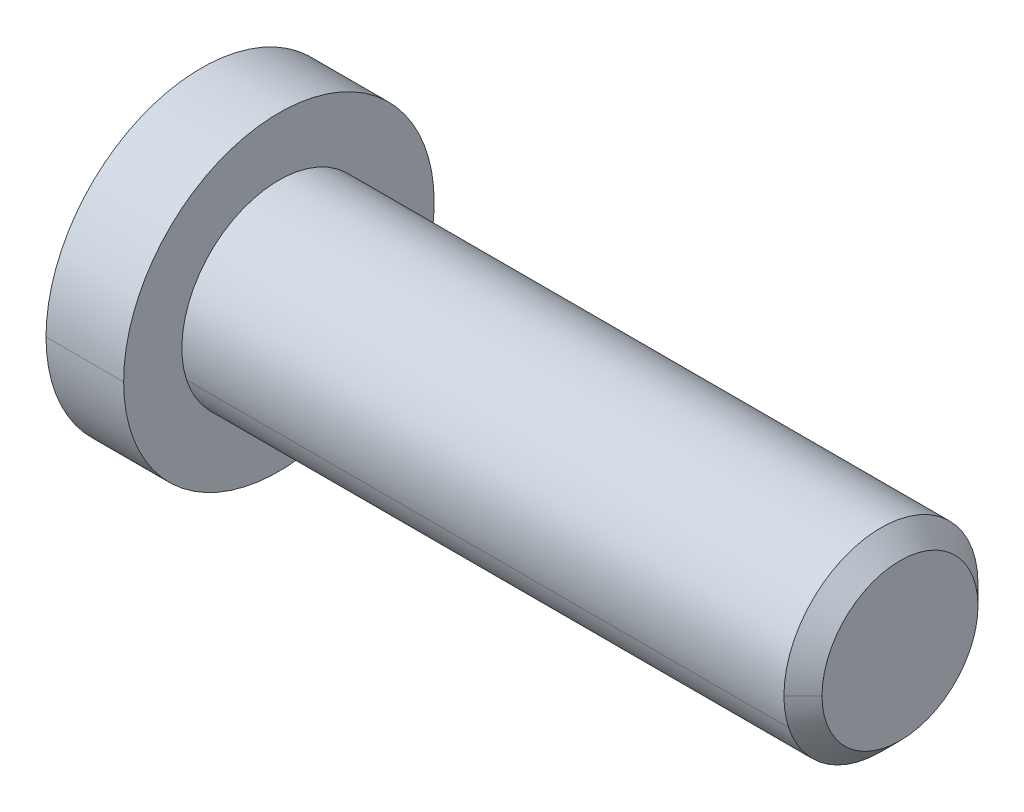
ISO-10303-21;
HEADER;
FILE_DESCRIPTION(('STEP AP214'),'2;1');
FILE_NAME('part.step','',(''),(''),'','','');
FILE_SCHEMA(('AUTOMOTIVE_DESIGN { 1 0 10303 214 1 1 1 1 }'));
ENDSEC;
DATA;
#1=APPLICATION_CONTEXT('core data for automotive mechanical design processes');
#2=APPLICATION_PROTOCOL_DEFINITION('international standard','automotive_design',2000,#1);
#3=PRODUCT_CONTEXT('',#1,'mechanical');
#4=PRODUCT('Part','Part','',(#3));
#5=PRODUCT_RELATED_PRODUCT_CATEGORY('part','',(#4));
#6=PRODUCT_DEFINITION_FORMATION('','',#4);
#7=PRODUCT_DEFINITION_CONTEXT('part definition',#1,'design');
#8=PRODUCT_DEFINITION('design','',#6,#7);
#9=PRODUCT_DEFINITION_SHAPE('','',#8);
#10=(LENGTH_UNIT() NAMED_UNIT(*) SI_UNIT(.MILLI.,.METRE.));
#11=(NAMED_UNIT(*) PLANE_ANGLE_UNIT() SI_UNIT($,.RADIAN.));
#12=(NAMED_UNIT(*) SI_UNIT($,.STERADIAN.) SOLID_ANGLE_UNIT());
#13=UNCERTAINTY_MEASURE_WITH_UNIT(LENGTH_MEASURE(1.E-05),#10,'distance_accuracy_value','');
#14=(GEOMETRIC_REPRESENTATION_CONTEXT(3) GLOBAL_UNCERTAINTY_ASSIGNED_CONTEXT((#13)) GLOBAL_UNIT_ASSIGNED_CONTEXT((#10,
#11,#12)) REPRESENTATION_CONTEXT('',''));
#15=CARTESIAN_POINT('',(0.,0.,0.));
#16=DIRECTION('',(0.,0.,1.));
#17=DIRECTION('',(1.,0.,0.));
#18=AXIS2_PLACEMENT_3D('',#15,#16,#17);
#19=CARTESIAN_POINT('',(0.,0.,0.));
#20=DIRECTION('',(1.,0.,0.));
#21=DIRECTION('',(0.,0.,-1.));
#22=AXIS2_PLACEMENT_3D('',#19,#20,#21);
#23=PLANE('',#22);
#24=CARTESIAN_POINT('',(0.,0.,0.));
#25=DIRECTION('',(1.,0.,0.));
#26=DIRECTION('',(0.,0.,-1.));
#27=AXIS2_PLACEMENT_3D('',#24,#25,#26);
#28=CIRCLE('',#27,4.);
#29=CARTESIAN_POINT('',(0.,0.,4.));
#30=VERTEX_POINT('',#29);
#31=CARTESIAN_POINT('',(0.,0.,-4.));
#32=VERTEX_POINT('',#31);
#33=EDGE_CURVE('E11',#30,#32,#28,.T.);
#34=ORIENTED_EDGE('',*,*,#33,.F.);
#35=CARTESIAN_POINT('',(0.,0.,0.));
#36=DIRECTION('',(1.,0.,0.));
#37=DIRECTION('',(0.,0.,-1.));
#38=AXIS2_PLACEMENT_3D('',#35,#36,#37);
#39=CIRCLE('',#38,4.);
#40=EDGE_CURVE('E25',#32,#30,#39,.T.);
#41=ORIENTED_EDGE('',*,*,#40,.F.);
#42=EDGE_LOOP('',(#34,#41));
#43=FACE_BOUND('',#42,.T.);
#44=DIRECTION('',(0.,0.50000000000002,-0.866025403784427));
#45=VECTOR('',#44,1.);
#46=CARTESIAN_POINT('',(0.,-1.4433756729741,0.));
#47=LINE('',#46,#45);
#48=CARTESIAN_POINT('',(0.,-1.4433756729741,0.));
#49=VERTEX_POINT('',#48);
#50=CARTESIAN_POINT('',(0.,-0.72168783648703,-1.25));
#51=VERTEX_POINT('',#50);
#52=EDGE_CURVE('E360',#49,#51,#47,.T.);
#53=ORIENTED_EDGE('',*,*,#52,.T.);
#54=DIRECTION('',(0.,1.,0.));
#55=VECTOR('',#54,1.);
#56=CARTESIAN_POINT('',(0.,-0.72168783648703,-1.25));
#57=LINE('',#56,#55);
#58=CARTESIAN_POINT('',(0.,0.72168783648703,-1.25));
#59=VERTEX_POINT('',#58);
#60=EDGE_CURVE('E356',#51,#59,#57,.T.);
#61=ORIENTED_EDGE('',*,*,#60,.T.);
#62=DIRECTION('',(0.,0.50000000000002,0.866025403784427));
#63=VECTOR('',#62,1.);
#64=CARTESIAN_POINT('',(0.,0.72168783648703,-1.25));
#65=LINE('',#64,#63);
#66=CARTESIAN_POINT('',(0.,1.4433756729741,0.));
#67=VERTEX_POINT('',#66);
#68=EDGE_CURVE('E352',#59,#67,#65,.T.);
#69=ORIENTED_EDGE('',*,*,#68,.T.);
#70=DIRECTION('',(0.,-0.50000000000002,0.866025403784427));
#71=VECTOR('',#70,1.);
#72=CARTESIAN_POINT('',(0.,1.4433756729741,0.));
#73=LINE('',#72,#71);
#74=CARTESIAN_POINT('',(0.,0.72168783648703,1.25));
#75=VERTEX_POINT('',#74);
#76=EDGE_CURVE('E348',#67,#75,#73,.T.);
#77=ORIENTED_EDGE('',*,*,#76,.T.);
#78=DIRECTION('',(0.,-1.,0.));
#79=VECTOR('',#78,1.);
#80=CARTESIAN_POINT('',(0.,0.72168783648703,1.25));
#81=LINE('',#80,#79);
#82=CARTESIAN_POINT('',(0.,-0.72168783648703,1.25));
#83=VERTEX_POINT('',#82);
#84=EDGE_CURVE('E344',#75,#83,#81,.T.);
#85=ORIENTED_EDGE('',*,*,#84,.T.);
#86=DIRECTION('',(0.,-0.50000000000002,-0.866025403784427));
#87=VECTOR('',#86,1.);
#88=CARTESIAN_POINT('',(0.,-0.72168783648703,1.25));
#89=LINE('',#88,#87);
#90=EDGE_CURVE('E340',#83,#49,#89,.T.);
#91=ORIENTED_EDGE('',*,*,#90,.T.);
#92=EDGE_LOOP('',(#53,#61,#69,#77,#85,#91));
#93=FACE_BOUND('',#92,.T.);
#94=ADVANCED_FACE('F17',(#43,#93),#23,.F.);
#95=CARTESIAN_POINT('',(1.5,-0.72168783648703,1.25));
#96=DIRECTION('',(0.,0.866025403784427,-0.50000000000002));
#97=DIRECTION('',(0.,0.50000000000002,0.866025403784427));
#98=AXIS2_PLACEMENT_3D('',#95,#96,#97);
#99=PLANE('',#98);
#100=ORIENTED_EDGE('',*,*,#90,.F.);
#101=DIRECTION('',(-1.,0.,0.));
#102=VECTOR('',#101,1.);
#103=CARTESIAN_POINT('',(1.5,-0.72168783648703,1.25));
#104=LINE('',#103,#102);
#105=CARTESIAN_POINT('',(1.5,-0.72168783648703,1.25));
#106=VERTEX_POINT('',#105);
#107=EDGE_CURVE('E335',#106,#83,#104,.T.);
#108=ORIENTED_EDGE('',*,*,#107,.F.);
#109=DIRECTION('',(0.,-0.50000000000002,-0.866025403784427));
#110=VECTOR('',#109,1.);
#111=CARTESIAN_POINT('',(1.5,-0.72168783648703,1.25));
#112=LINE('',#111,#110);
#113=CARTESIAN_POINT('',(1.5,-1.08253175473055,0.625000000000032));
#114=VERTEX_POINT('',#113);
#115=EDGE_CURVE('E331',#106,#114,#112,.T.);
#116=ORIENTED_EDGE('',*,*,#115,.T.);
#117=DIRECTION('',(0.,-0.50000000000002,-0.866025403784427));
#118=VECTOR('',#117,1.);
#119=CARTESIAN_POINT('',(1.5,-0.72168783648703,1.25));
#120=LINE('',#119,#118);
#121=CARTESIAN_POINT('',(1.5,-1.4433756729741,0.));
#122=VERTEX_POINT('',#121);
#123=EDGE_CURVE('E327',#114,#122,#120,.T.);
#124=ORIENTED_EDGE('',*,*,#123,.T.);
#125=DIRECTION('',(-1.,0.,0.));
#126=VECTOR('',#125,1.);
#127=CARTESIAN_POINT('',(1.5,-1.4433756729741,0.));
#128=LINE('',#127,#126);
#129=EDGE_CURVE('E322',#122,#49,#128,.T.);
#130=ORIENTED_EDGE('',*,*,#129,.T.);
#131=EDGE_LOOP('',(#100,#108,#116,#124,#130));
#132=FACE_BOUND('',#131,.T.);
#133=ADVANCED_FACE('F389',(#132),#99,.T.);
#134=CARTESIAN_POINT('',(1.5,-1.4433756729741,0.));
#135=DIRECTION('',(0.,0.866025403784427,0.50000000000002));
#136=DIRECTION('',(0.,-0.50000000000002,0.866025403784427));
#137=AXIS2_PLACEMENT_3D('',#134,#135,#136);
#138=PLANE('',#137);
#139=ORIENTED_EDGE('',*,*,#52,.F.);
#140=ORIENTED_EDGE('',*,*,#129,.F.);
#141=DIRECTION('',(0.,0.50000000000002,-0.866025403784427));
#142=VECTOR('',#141,1.);
#143=CARTESIAN_POINT('',(1.5,-1.4433756729741,0.));
#144=LINE('',#143,#142);
#145=CARTESIAN_POINT('',(1.5,-1.08253175473055,-0.625000000000032));
#146=VERTEX_POINT('',#145);
#147=EDGE_CURVE('E318',#122,#146,#144,.T.);
#148=ORIENTED_EDGE('',*,*,#147,.T.);
#149=DIRECTION('',(0.,0.50000000000002,-0.866025403784427));
#150=VECTOR('',#149,1.);
#151=CARTESIAN_POINT('',(1.5,-1.4433756729741,0.));
#152=LINE('',#151,#150);
#153=CARTESIAN_POINT('',(1.5,-0.72168783648703,-1.25));
#154=VERTEX_POINT('',#153);
#155=EDGE_CURVE('E314',#146,#154,#152,.T.);
#156=ORIENTED_EDGE('',*,*,#155,.T.);
#157=DIRECTION('',(-1.,0.,0.));
#158=VECTOR('',#157,1.);
#159=CARTESIAN_POINT('',(1.5,-0.72168783648703,-1.25));
#160=LINE('',#159,#158);
#161=EDGE_CURVE('E309',#154,#51,#160,.T.);
#162=ORIENTED_EDGE('',*,*,#161,.T.);
#163=EDGE_LOOP('',(#139,#140,#148,#156,#162));
#164=FACE_BOUND('',#163,.T.);
#165=ADVANCED_FACE('F393',(#164),#138,.T.);
#166=CARTESIAN_POINT('',(1.5,-0.72168783648703,-1.25));
#167=DIRECTION('',(0.,0.,1.));
#168=DIRECTION('',(1.,0.,0.));
#169=AXIS2_PLACEMENT_3D('',#166,#167,#168);
#170=PLANE('',#169);
#171=ORIENTED_EDGE('',*,*,#60,.F.);
#172=ORIENTED_EDGE('',*,*,#161,.F.);
#173=DIRECTION('',(0.,1.,0.));
#174=VECTOR('',#173,1.);
#175=CARTESIAN_POINT('',(1.5,-0.72168783648703,-1.25));
#176=LINE('',#175,#174);
#177=CARTESIAN_POINT('',(1.5,0.,-1.25));
#178=VERTEX_POINT('',#177);
#179=EDGE_CURVE('E305',#154,#178,#176,.T.);
#180=ORIENTED_EDGE('',*,*,#179,.T.);
#181=DIRECTION('',(0.,1.,0.));
#182=VECTOR('',#181,1.);
#183=CARTESIAN_POINT('',(1.5,-0.72168783648703,-1.25));
#184=LINE('',#183,#182);
#185=CARTESIAN_POINT('',(1.5,0.72168783648703,-1.25));
#186=VERTEX_POINT('',#185);
#187=EDGE_CURVE('E301',#178,#186,#184,.T.);
#188=ORIENTED_EDGE('',*,*,#187,.T.);
#189=DIRECTION('',(-1.,0.,0.));
#190=VECTOR('',#189,1.);
#191=CARTESIAN_POINT('',(1.5,0.72168783648703,-1.25));
#192=LINE('',#191,#190);
#193=EDGE_CURVE('E296',#186,#59,#192,.T.);
#194=ORIENTED_EDGE('',*,*,#193,.T.);
#195=EDGE_LOOP('',(#171,#172,#180,#188,#194));
#196=FACE_BOUND('',#195,.T.);
#197=ADVANCED_FACE('F405',(#196),#170,.T.);
#198=CARTESIAN_POINT('',(1.5,0.72168783648703,-1.25));
#199=DIRECTION('',(0.,-0.866025403784427,0.50000000000002));
#200=DIRECTION('',(0.,-0.50000000000002,-0.866025403784427));
#201=AXIS2_PLACEMENT_3D('',#198,#199,#200);
#202=PLANE('',#201);
#203=ORIENTED_EDGE('',*,*,#68,.F.);
#204=ORIENTED_EDGE('',*,*,#193,.F.);
#205=DIRECTION('',(0.,0.50000000000002,0.866025403784427));
#206=VECTOR('',#205,1.);
#207=CARTESIAN_POINT('',(1.5,0.72168783648703,-1.25));
#208=LINE('',#207,#206);
#209=CARTESIAN_POINT('',(1.5,1.08253175473055,-0.625000000000032));
#210=VERTEX_POINT('',#209);
#211=EDGE_CURVE('E292',#186,#210,#208,.T.);
#212=ORIENTED_EDGE('',*,*,#211,.T.);
#213=DIRECTION('',(0.,0.50000000000002,0.866025403784427));
#214=VECTOR('',#213,1.);
#215=CARTESIAN_POINT('',(1.5,0.72168783648703,-1.25));
#216=LINE('',#215,#214);
#217=CARTESIAN_POINT('',(1.5,1.4433756729741,0.));
#218=VERTEX_POINT('',#217);
#219=EDGE_CURVE('E288',#210,#218,#216,.T.);
#220=ORIENTED_EDGE('',*,*,#219,.T.);
#221=DIRECTION('',(-1.,0.,0.));
#222=VECTOR('',#221,1.);
#223=CARTESIAN_POINT('',(1.5,1.4433756729741,0.));
#224=LINE('',#223,#222);
#225=EDGE_CURVE('E283',#218,#67,#224,.T.);
#226=ORIENTED_EDGE('',*,*,#225,.T.);
#227=EDGE_LOOP('',(#203,#204,#212,#220,#226));
#228=FACE_BOUND('',#227,.T.);
#229=ADVANCED_FACE('F411',(#228),#202,.T.);
#230=CARTESIAN_POINT('',(1.5,1.4433756729741,0.));
#231=DIRECTION('',(0.,-0.866025403784427,-0.50000000000002));
#232=DIRECTION('',(0.,0.50000000000002,-0.866025403784427));
#233=AXIS2_PLACEMENT_3D('',#230,#231,#232);
#234=PLANE('',#233);
#235=ORIENTED_EDGE('',*,*,#76,.F.);
#236=ORIENTED_EDGE('',*,*,#225,.F.);
#237=DIRECTION('',(0.,-0.50000000000002,0.866025403784427));
#238=VECTOR('',#237,1.);
#239=CARTESIAN_POINT('',(1.5,1.4433756729741,0.));
#240=LINE('',#239,#238);
#241=CARTESIAN_POINT('',(1.5,1.08253175473055,0.625000000000032));
#242=VERTEX_POINT('',#241);
#243=EDGE_CURVE('E279',#218,#242,#240,.T.);
#244=ORIENTED_EDGE('',*,*,#243,.T.);
#245=DIRECTION('',(0.,-0.50000000000002,0.866025403784427));
#246=VECTOR('',#245,1.);
#247=CARTESIAN_POINT('',(1.5,1.4433756729741,0.));
#248=LINE('',#247,#246);
#249=CARTESIAN_POINT('',(1.5,0.72168783648703,1.25));
#250=VERTEX_POINT('',#249);
#251=EDGE_CURVE('E275',#242,#250,#248,.T.);
#252=ORIENTED_EDGE('',*,*,#251,.T.);
#253=DIRECTION('',(-1.,0.,0.));
#254=VECTOR('',#253,1.);
#255=CARTESIAN_POINT('',(1.5,0.72168783648703,1.25));
#256=LINE('',#255,#254);
#257=EDGE_CURVE('E270',#250,#75,#256,.T.);
#258=ORIENTED_EDGE('',*,*,#257,.T.);
#259=EDGE_LOOP('',(#235,#236,#244,#252,#258));
#260=FACE_BOUND('',#259,.T.);
#261=ADVANCED_FACE('F417',(#260),#234,.T.);
#262=CARTESIAN_POINT('',(1.5,0.72168783648703,1.25));
#263=DIRECTION('',(0.,0.,-1.));
#264=DIRECTION('',(-1.,0.,0.));
#265=AXIS2_PLACEMENT_3D('',#262,#263,#264);
#266=PLANE('',#265);
#267=ORIENTED_EDGE('',*,*,#84,.F.);
#268=ORIENTED_EDGE('',*,*,#257,.F.);
#269=DIRECTION('',(0.,-1.,0.));
#270=VECTOR('',#269,1.);
#271=CARTESIAN_POINT('',(1.5,0.72168783648703,1.25));
#272=LINE('',#271,#270);
#273=CARTESIAN_POINT('',(1.5,0.,1.25));
#274=VERTEX_POINT('',#273);
#275=EDGE_CURVE('E266',#250,#274,#272,.T.);
#276=ORIENTED_EDGE('',*,*,#275,.T.);
#277=DIRECTION('',(0.,-1.,0.));
#278=VECTOR('',#277,1.);
#279=CARTESIAN_POINT('',(1.5,0.72168783648703,1.25));
#280=LINE('',#279,#278);
#281=EDGE_CURVE('E261',#274,#106,#280,.T.);
#282=ORIENTED_EDGE('',*,*,#281,.T.);
#283=ORIENTED_EDGE('',*,*,#107,.T.);
#284=EDGE_LOOP('',(#267,#268,#276,#282,#283));
#285=FACE_BOUND('',#284,.T.);
#286=ADVANCED_FACE('F421',(#285),#266,.T.);
#287=CARTESIAN_POINT('',(1.5,0.,0.));
#288=DIRECTION('',(1.,0.,0.));
#289=DIRECTION('',(0.,0.,-1.));
#290=AXIS2_PLACEMENT_3D('',#287,#288,#289);
#291=PLANE('',#290);
#292=CARTESIAN_POINT('',(1.5,0.,0.));
#293=DIRECTION('',(1.,0.,0.));
#294=DIRECTION('',(0.,0.,-1.));
#295=AXIS2_PLACEMENT_3D('',#292,#293,#294);
#296=CIRCLE('',#295,1.25);
#297=EDGE_CURVE('E256',#274,#114,#296,.T.);
#298=ORIENTED_EDGE('',*,*,#297,.T.);
#299=ORIENTED_EDGE('',*,*,#115,.F.);
#300=ORIENTED_EDGE('',*,*,#281,.F.);
#301=EDGE_LOOP('',(#298,#299,#300));
#302=FACE_BOUND('',#301,.T.);
#303=ADVANCED_FACE('F445',(#302),#291,.F.);
#304=CARTESIAN_POINT('',(3.721687836487,0.,0.));
#305=DIRECTION('',(1.,0.,0.));
#306=DIRECTION('',(0.,1.,0.));
#307=AXIS2_PLACEMENT_3D('',#304,#305,#306);
#308=CYLINDRICAL_SURFACE('',#307,1.25);
#309=DIRECTION('',(1.,0.,0.));
#310=VECTOR('',#309,1.);
#311=CARTESIAN_POINT('',(1.5,0.,1.25));
#312=LINE('',#311,#310);
#313=CARTESIAN_POINT('',(3.,0.,1.25));
#314=VERTEX_POINT('',#313);
#315=EDGE_CURVE('E252',#274,#314,#312,.T.);
#316=ORIENTED_EDGE('',*,*,#315,.T.);
#317=CARTESIAN_POINT('',(3.,0.,0.));
#318=DIRECTION('',(1.,0.,0.));
#319=DIRECTION('',(0.,0.,-1.));
#320=AXIS2_PLACEMENT_3D('',#317,#318,#319);
#321=CIRCLE('',#320,1.25);
#322=CARTESIAN_POINT('',(3.,0.,-1.25));
#323=VERTEX_POINT('',#322);
#324=EDGE_CURVE('E248',#314,#323,#321,.T.);
#325=ORIENTED_EDGE('',*,*,#324,.T.);
#326=DIRECTION('',(1.,0.,0.));
#327=VECTOR('',#326,1.);
#328=CARTESIAN_POINT('',(1.5,0.,-1.25));
#329=LINE('',#328,#327);
#330=EDGE_CURVE('E243',#178,#323,#329,.T.);
#331=ORIENTED_EDGE('',*,*,#330,.F.);
#332=CARTESIAN_POINT('',(1.5,0.,0.));
#333=DIRECTION('',(1.,0.,0.));
#334=DIRECTION('',(0.,0.,-1.));
#335=AXIS2_PLACEMENT_3D('',#332,#333,#334);
#336=CIRCLE('',#335,1.25);
#337=EDGE_CURVE('E238',#146,#178,#336,.T.);
#338=ORIENTED_EDGE('',*,*,#337,.F.);
#339=CARTESIAN_POINT('',(1.5,0.,0.));
#340=DIRECTION('',(1.,0.,0.));
#341=DIRECTION('',(0.,0.,-1.));
#342=AXIS2_PLACEMENT_3D('',#339,#340,#341);
#343=CIRCLE('',#342,1.25);
#344=EDGE_CURVE('E233',#114,#146,#343,.T.);
#345=ORIENTED_EDGE('',*,*,#344,.F.);
#346=ORIENTED_EDGE('',*,*,#297,.F.);
#347=EDGE_LOOP('',(#316,#325,#331,#338,#345,#346));
#348=FACE_BOUND('',#347,.T.);
#349=ADVANCED_FACE('F431',(#348),#308,.F.);
#350=CARTESIAN_POINT('',(1.5,0.,0.));
#351=DIRECTION('',(1.,0.,0.));
#352=DIRECTION('',(0.,0.,-1.));
#353=AXIS2_PLACEMENT_3D('',#350,#351,#352);
#354=PLANE('',#353);
#355=ORIENTED_EDGE('',*,*,#344,.T.);
#356=ORIENTED_EDGE('',*,*,#147,.F.);
#357=ORIENTED_EDGE('',*,*,#123,.F.);
#358=EDGE_LOOP('',(#355,#356,#357));
#359=FACE_BOUND('',#358,.T.);
#360=ADVANCED_FACE('F436',(#359),#354,.F.);
#361=CARTESIAN_POINT('',(1.5,0.,0.));
#362=DIRECTION('',(1.,0.,0.));
#363=DIRECTION('',(0.,0.,-1.));
#364=AXIS2_PLACEMENT_3D('',#361,#362,#363);
#365=PLANE('',#364);
#366=ORIENTED_EDGE('',*,*,#337,.T.);
#367=ORIENTED_EDGE('',*,*,#179,.F.);
#368=ORIENTED_EDGE('',*,*,#155,.F.);
#369=EDGE_LOOP('',(#366,#367,#368));
#370=FACE_BOUND('',#369,.T.);
#371=ADVANCED_FACE('F435',(#370),#365,.F.);
#372=CARTESIAN_POINT('',(3.721687836487,0.,0.));
#373=DIRECTION('',(1.,0.,0.));
#374=DIRECTION('',(0.,-1.,0.));
#375=AXIS2_PLACEMENT_3D('',#372,#373,#374);
#376=CYLINDRICAL_SURFACE('',#375,1.25);
#377=ORIENTED_EDGE('',*,*,#315,.F.);
#378=CARTESIAN_POINT('',(1.5,0.,0.));
#379=DIRECTION('',(1.,0.,0.));
#380=DIRECTION('',(0.,0.,-1.));
#381=AXIS2_PLACEMENT_3D('',#378,#379,#380);
#382=CIRCLE('',#381,1.25);
#383=EDGE_CURVE('E228',#242,#274,#382,.T.);
#384=ORIENTED_EDGE('',*,*,#383,.F.);
#385=CARTESIAN_POINT('',(1.5,0.,0.));
#386=DIRECTION('',(1.,0.,0.));
#387=DIRECTION('',(0.,0.,-1.));
#388=AXIS2_PLACEMENT_3D('',#385,#386,#387);
#389=CIRCLE('',#388,1.25);
#390=EDGE_CURVE('E223',#210,#242,#389,.T.);
#391=ORIENTED_EDGE('',*,*,#390,.F.);
#392=CARTESIAN_POINT('',(1.5,0.,0.));
#393=DIRECTION('',(1.,0.,0.));
#394=DIRECTION('',(0.,0.,-1.));
#395=AXIS2_PLACEMENT_3D('',#392,#393,#394);
#396=CIRCLE('',#395,1.25);
#397=EDGE_CURVE('E218',#178,#210,#396,.T.);
#398=ORIENTED_EDGE('',*,*,#397,.F.);
#399=ORIENTED_EDGE('',*,*,#330,.T.);
#400=CARTESIAN_POINT('',(3.,0.,0.));
#401=DIRECTION('',(1.,0.,0.));
#402=DIRECTION('',(0.,0.,-1.));
#403=AXIS2_PLACEMENT_3D('',#400,#401,#402);
#404=CIRCLE('',#403,1.25);
#405=EDGE_CURVE('E213',#323,#314,#404,.T.);
#406=ORIENTED_EDGE('',*,*,#405,.T.);
#407=EDGE_LOOP('',(#377,#384,#391,#398,#399,#406));
#408=FACE_BOUND('',#407,.T.);
#409=ADVANCED_FACE('F443',(#408),#376,.F.);
#410=CARTESIAN_POINT('',(3.,0.,0.));
#411=DIRECTION('',(-1.,0.,0.));
#412=DIRECTION('',(0.,-1.,0.));
#413=AXIS2_PLACEMENT_3D('',#410,#411,#412);
#414=CONICAL_SURFACE('',#413,1.25,1.04719755119662);
#415=DIRECTION('',(-0.499999999999983,0.,0.866025403784448));
#416=VECTOR('',#415,1.);
#417=CARTESIAN_POINT('',(3.721687836487,0.,0.));
#418=LINE('',#417,#416);
#419=CARTESIAN_POINT('',(3.721687836487,0.,0.));
#420=VERTEX_POINT('',#419);
#421=EDGE_CURVE('E208',#420,#314,#418,.T.);
#422=ORIENTED_EDGE('',*,*,#421,.T.);
#423=ORIENTED_EDGE('',*,*,#405,.F.);
#424=DIRECTION('',(-0.499999999999983,0.,-0.866025403784448));
#425=VECTOR('',#424,1.);
#426=CARTESIAN_POINT('',(3.721687836487,0.,0.));
#427=LINE('',#426,#425);
#428=EDGE_CURVE('E203',#420,#323,#427,.T.);
#429=ORIENTED_EDGE('',*,*,#428,.F.);
#430=EDGE_LOOP('',(#422,#423,#429));
#431=FACE_BOUND('',#430,.T.);
#432=ADVANCED_FACE('F516',(#431),#414,.F.);
#433=CARTESIAN_POINT('',(3.,0.,0.));
#434=DIRECTION('',(-1.,0.,0.));
#435=DIRECTION('',(0.,1.,0.));
#436=AXIS2_PLACEMENT_3D('',#433,#434,#435);
#437=CONICAL_SURFACE('',#436,1.25,1.04719755119662);
#438=ORIENTED_EDGE('',*,*,#428,.T.);
#439=ORIENTED_EDGE('',*,*,#324,.F.);
#440=ORIENTED_EDGE('',*,*,#421,.F.);
#441=EDGE_LOOP('',(#438,#439,#440));
#442=FACE_BOUND('',#441,.T.);
#443=ADVANCED_FACE('F526',(#442),#437,.F.);
#444=CARTESIAN_POINT('',(1.5,0.,0.));
#445=DIRECTION('',(1.,0.,0.));
#446=DIRECTION('',(0.,0.,-1.));
#447=AXIS2_PLACEMENT_3D('',#444,#445,#446);
#448=PLANE('',#447);
#449=ORIENTED_EDGE('',*,*,#397,.T.);
#450=ORIENTED_EDGE('',*,*,#211,.F.);
#451=ORIENTED_EDGE('',*,*,#187,.F.);
#452=EDGE_LOOP('',(#449,#450,#451));
#453=FACE_BOUND('',#452,.T.);
#454=ADVANCED_FACE('F537',(#453),#448,.F.);
#455=CARTESIAN_POINT('',(1.5,0.,0.));
#456=DIRECTION('',(1.,0.,0.));
#457=DIRECTION('',(0.,0.,-1.));
#458=AXIS2_PLACEMENT_3D('',#455,#456,#457);
#459=PLANE('',#458);
#460=ORIENTED_EDGE('',*,*,#219,.F.);
#461=ORIENTED_EDGE('',*,*,#390,.T.);
#462=ORIENTED_EDGE('',*,*,#243,.F.);
#463=EDGE_LOOP('',(#460,#461,#462));
#464=FACE_BOUND('',#463,.T.);
#465=ADVANCED_FACE('F548',(#464),#459,.F.);
#466=CARTESIAN_POINT('',(1.5,0.,0.));
#467=DIRECTION('',(1.,0.,0.));
#468=DIRECTION('',(0.,0.,-1.));
#469=AXIS2_PLACEMENT_3D('',#466,#467,#468);
#470=PLANE('',#469);
#471=ORIENTED_EDGE('',*,*,#383,.T.);
#472=ORIENTED_EDGE('',*,*,#275,.F.);
#473=ORIENTED_EDGE('',*,*,#251,.F.);
#474=EDGE_LOOP('',(#471,#472,#473));
#475=FACE_BOUND('',#474,.T.);
#476=ADVANCED_FACE('F559',(#475),#470,.F.);
#477=CARTESIAN_POINT('',(18.,0.,0.));
#478=DIRECTION('',(1.,0.,0.));
#479=DIRECTION('',(0.,-1.,0.));
#480=AXIS2_PLACEMENT_3D('',#477,#478,#479);
#481=CYLINDRICAL_SURFACE('',#480,4.);
#482=DIRECTION('',(1.,0.,0.));
#483=VECTOR('',#482,1.);
#484=CARTESIAN_POINT('',(0.,0.,4.));
#485=LINE('',#484,#483);
#486=CARTESIAN_POINT('',(2.,0.,4.));
#487=VERTEX_POINT('',#486);
#488=EDGE_CURVE('E199',#30,#487,#485,.T.);
#489=ORIENTED_EDGE('',*,*,#488,.T.);
#490=CARTESIAN_POINT('',(2.,0.,0.));
#491=DIRECTION('',(1.,0.,0.));
#492=DIRECTION('',(0.,0.,-1.));
#493=AXIS2_PLACEMENT_3D('',#490,#491,#492);
#494=CIRCLE('',#493,4.);
#495=CARTESIAN_POINT('',(2.,0.,-4.));
#496=VERTEX_POINT('',#495);
#497=EDGE_CURVE('E194',#496,#487,#494,.T.);
#498=ORIENTED_EDGE('',*,*,#497,.F.);
#499=DIRECTION('',(1.,0.,0.));
#500=VECTOR('',#499,1.);
#501=CARTESIAN_POINT('',(0.,0.,-4.));
#502=LINE('',#501,#500);
#503=EDGE_CURVE('E189',#32,#496,#502,.T.);
#504=ORIENTED_EDGE('',*,*,#503,.F.);
#505=ORIENTED_EDGE('',*,*,#40,.T.);
#506=EDGE_LOOP('',(#489,#498,#504,#505));
#507=FACE_BOUND('',#506,.T.);
#508=ADVANCED_FACE('F369',(#507),#481,.T.);
#509=CARTESIAN_POINT('',(18.,0.,0.));
#510=DIRECTION('',(1.,0.,0.));
#511=DIRECTION('',(0.,1.,0.));
#512=AXIS2_PLACEMENT_3D('',#509,#510,#511);
#513=CYLINDRICAL_SURFACE('',#512,4.);
#514=ORIENTED_EDGE('',*,*,#488,.F.);
#515=ORIENTED_EDGE('',*,*,#33,.T.);
#516=ORIENTED_EDGE('',*,*,#503,.T.);
#517=CARTESIAN_POINT('',(2.,0.,0.));
#518=DIRECTION('',(1.,0.,0.));
#519=DIRECTION('',(0.,0.,-1.));
#520=AXIS2_PLACEMENT_3D('',#517,#518,#519);
#521=CIRCLE('',#520,4.);
#522=EDGE_CURVE('E184',#487,#496,#521,.T.);
#523=ORIENTED_EDGE('',*,*,#522,.F.);
#524=EDGE_LOOP('',(#514,#515,#516,#523));
#525=FACE_BOUND('',#524,.T.);
#526=ADVANCED_FACE('F372',(#525),#513,.T.);
#527=CARTESIAN_POINT('',(2.,4.,0.));
#528=DIRECTION('',(-1.,0.,0.));
#529=DIRECTION('',(0.,0.,1.));
#530=AXIS2_PLACEMENT_3D('',#527,#528,#529);
#531=PLANE('',#530);
#532=CARTESIAN_POINT('',(2.,0.,0.));
#533=DIRECTION('',(1.,0.,0.));
#534=DIRECTION('',(0.,0.,-1.));
#535=AXIS2_PLACEMENT_3D('',#532,#533,#534);
#536=CIRCLE('',#535,2.5);
#537=CARTESIAN_POINT('',(2.,-0.772542485937367,2.37764129073788));
#538=VERTEX_POINT('',#537);
#539=CARTESIAN_POINT('',(2.,0.,-2.5));
#540=VERTEX_POINT('',#539);
#541=EDGE_CURVE('E179',#538,#540,#536,.T.);
#542=ORIENTED_EDGE('',*,*,#541,.F.);
#543=CARTESIAN_POINT('',(2.,0.,0.));
#544=DIRECTION('',(1.,0.,0.));
#545=DIRECTION('',(0.,0.,-1.));
#546=AXIS2_PLACEMENT_3D('',#543,#544,#545);
#547=CIRCLE('',#546,2.5);
#548=EDGE_CURVE('E174',#540,#538,#547,.T.);
#549=ORIENTED_EDGE('',*,*,#548,.F.);
#550=EDGE_LOOP('',(#542,#549));
#551=FACE_BOUND('',#550,.T.);
#552=ORIENTED_EDGE('',*,*,#497,.T.);
#553=ORIENTED_EDGE('',*,*,#522,.T.);
#554=EDGE_LOOP('',(#552,#553));
#555=FACE_BOUND('',#554,.T.);
#556=ADVANCED_FACE('F374',(#551,#555),#531,.F.);
#557=CARTESIAN_POINT('',(18.,0.,0.));
#558=DIRECTION('',(1.,0.,0.));
#559=DIRECTION('',(0.,-0.987688340595138,-0.156434465040231));
#560=AXIS2_PLACEMENT_3D('',#557,#558,#559);
#561=CYLINDRICAL_SURFACE('',#560,2.5);
#562=DIRECTION('',(1.,0.,0.));
#563=VECTOR('',#562,1.);
#564=CARTESIAN_POINT('',(2.,-0.772542485937367,2.37764129073788));
#565=LINE('',#564,#563);
#566=CARTESIAN_POINT('',(17.5095,-0.772542485937367,2.37764129073788));
#567=VERTEX_POINT('',#566);
#568=EDGE_CURVE('E170',#538,#567,#565,.T.);
#569=ORIENTED_EDGE('',*,*,#568,.T.);
#570=CARTESIAN_POINT('',(17.5095,0.,0.));
#571=DIRECTION('',(1.,0.,0.));
#572=DIRECTION('',(0.,0.,-1.));
#573=AXIS2_PLACEMENT_3D('',#570,#571,#572);
#574=CIRCLE('',#573,2.5);
#575=CARTESIAN_POINT('',(17.5095,0.,2.5));
#576=VERTEX_POINT('',#575);
#577=EDGE_CURVE('E166',#576,#567,#574,.T.);
#578=ORIENTED_EDGE('',*,*,#577,.F.);
#579=CARTESIAN_POINT('',(17.5095,0.,0.));
#580=DIRECTION('',(1.,0.,0.));
#581=DIRECTION('',(0.,0.,-1.));
#582=AXIS2_PLACEMENT_3D('',#579,#580,#581);
#583=CIRCLE('',#582,2.5);
#584=CARTESIAN_POINT('',(17.5095,0.,-2.5));
#585=VERTEX_POINT('',#584);
#586=EDGE_CURVE('E144',#585,#576,#583,.T.);
#587=ORIENTED_EDGE('',*,*,#586,.F.);
#588=DIRECTION('',(1.,0.,0.));
#589=VECTOR('',#588,1.);
#590=CARTESIAN_POINT('',(2.,0.,-2.5));
#591=LINE('',#590,#589);
#592=EDGE_CURVE('E158',#540,#585,#591,.T.);
#593=ORIENTED_EDGE('',*,*,#592,.F.);
#594=ORIENTED_EDGE('',*,*,#548,.T.);
#595=EDGE_LOOP('',(#569,#578,#587,#593,#594));
#596=FACE_BOUND('',#595,.T.);
#597=ADVANCED_FACE('F376',(#596),#561,.T.);
#598=CARTESIAN_POINT('',(18.,0.,0.));
#599=DIRECTION('',(1.,0.,0.));
#600=DIRECTION('',(0.,0.987688340595138,0.156434465040231));
#601=AXIS2_PLACEMENT_3D('',#598,#599,#600);
#602=CYLINDRICAL_SURFACE('',#601,2.5);
#603=ORIENTED_EDGE('',*,*,#568,.F.);
#604=ORIENTED_EDGE('',*,*,#541,.T.);
#605=ORIENTED_EDGE('',*,*,#592,.T.);
#606=CARTESIAN_POINT('',(17.5095,0.,0.));
#607=DIRECTION('',(1.,0.,0.));
#608=DIRECTION('',(0.,0.,-1.));
#609=AXIS2_PLACEMENT_3D('',#606,#607,#608);
#610=CIRCLE('',#609,2.5);
#611=EDGE_CURVE('E154',#567,#585,#610,.T.);
#612=ORIENTED_EDGE('',*,*,#611,.F.);
#613=EDGE_LOOP('',(#603,#604,#605,#612));
#614=FACE_BOUND('',#613,.T.);
#615=ADVANCED_FACE('F384',(#614),#602,.T.);
#616=CARTESIAN_POINT('',(17.5095,0.,0.));
#617=DIRECTION('',(-1.,0.,0.));
#618=DIRECTION('',(0.,1.,0.));
#619=AXIS2_PLACEMENT_3D('',#616,#617,#618);
#620=CONICAL_SURFACE('',#619,2.5,0.785398163397447);
#621=DIRECTION('',(-0.707106781186548,0.,-0.707106781186547));
#622=VECTOR('',#621,1.);
#623=CARTESIAN_POINT('',(18.,0.,-2.0095));
#624=LINE('',#623,#622);
#625=CARTESIAN_POINT('',(18.,0.,-2.0095));
#626=VERTEX_POINT('',#625);
#627=EDGE_CURVE('E135',#626,#585,#624,.T.);
#628=ORIENTED_EDGE('',*,*,#627,.F.);
#629=CARTESIAN_POINT('',(18.,0.,0.));
#630=DIRECTION('',(1.,0.,0.));
#631=DIRECTION('',(0.,0.,-1.));
#632=AXIS2_PLACEMENT_3D('',#629,#630,#631);
#633=CIRCLE('',#632,2.0095);
#634=CARTESIAN_POINT('',(18.,0.,2.0095));
#635=VERTEX_POINT('',#634);
#636=EDGE_CURVE('E126',#635,#626,#633,.T.);
#637=ORIENTED_EDGE('',*,*,#636,.F.);
#638=DIRECTION('',(-0.707106781186548,0.,0.707106781186547));
#639=VECTOR('',#638,1.);
#640=CARTESIAN_POINT('',(18.,0.,2.0095));
#641=LINE('',#640,#639);
#642=EDGE_CURVE('E131',#635,#576,#641,.T.);
#643=ORIENTED_EDGE('',*,*,#642,.T.);
#644=ORIENTED_EDGE('',*,*,#577,.T.);
#645=ORIENTED_EDGE('',*,*,#611,.T.);
#646=EDGE_LOOP('',(#628,#637,#643,#644,#645));
#647=FACE_BOUND('',#646,.T.);
#648=ADVANCED_FACE('F128',(#647),#620,.T.);
#649=CARTESIAN_POINT('',(17.5095,0.,0.));
#650=DIRECTION('',(-1.,0.,0.));
#651=DIRECTION('',(0.,-1.,0.));
#652=AXIS2_PLACEMENT_3D('',#649,#650,#651);
#653=CONICAL_SURFACE('',#652,2.5,0.785398163397447);
#654=ORIENTED_EDGE('',*,*,#627,.T.);
#655=ORIENTED_EDGE('',*,*,#586,.T.);
#656=ORIENTED_EDGE('',*,*,#642,.F.);
#657=CARTESIAN_POINT('',(18.,0.,0.));
#658=DIRECTION('',(1.,0.,0.));
#659=DIRECTION('',(0.,0.,-1.));
#660=AXIS2_PLACEMENT_3D('',#657,#658,#659);
#661=CIRCLE('',#660,2.0095);
#662=EDGE_CURVE('E139',#626,#635,#661,.T.);
#663=ORIENTED_EDGE('',*,*,#662,.F.);
#664=EDGE_LOOP('',(#654,#655,#656,#663));
#665=FACE_BOUND('',#664,.T.);
#666=ADVANCED_FACE('F143',(#665),#653,.T.);
#667=CARTESIAN_POINT('',(18.,2.0095,0.));
#668=DIRECTION('',(-1.,0.,0.));
#669=DIRECTION('',(0.,0.,1.));
#670=AXIS2_PLACEMENT_3D('',#667,#668,#669);
#671=PLANE('',#670);
#672=ORIENTED_EDGE('',*,*,#662,.T.);
#673=ORIENTED_EDGE('',*,*,#636,.T.);
#674=EDGE_LOOP('',(#672,#673));
#675=FACE_BOUND('',#674,.T.);
#676=ADVANCED_FACE('F140',(#675),#671,.F.);
#677=CLOSED_SHELL('',(#94,#133,#165,#197,#229,#261,#286,#303,#349,#360,#371,#409,#432,#443,#454,
#465,#476,#508,#526,#556,#597,#615,#648,#666,#676));
#678=MANIFOLD_SOLID_BREP('B1',#677);
#679=ADVANCED_BREP_SHAPE_REPRESENTATION('',(#18,#678),#14);
#680=SHAPE_DEFINITION_REPRESENTATION(#9,#679);
ENDSEC;
END-ISO-10303-21;
